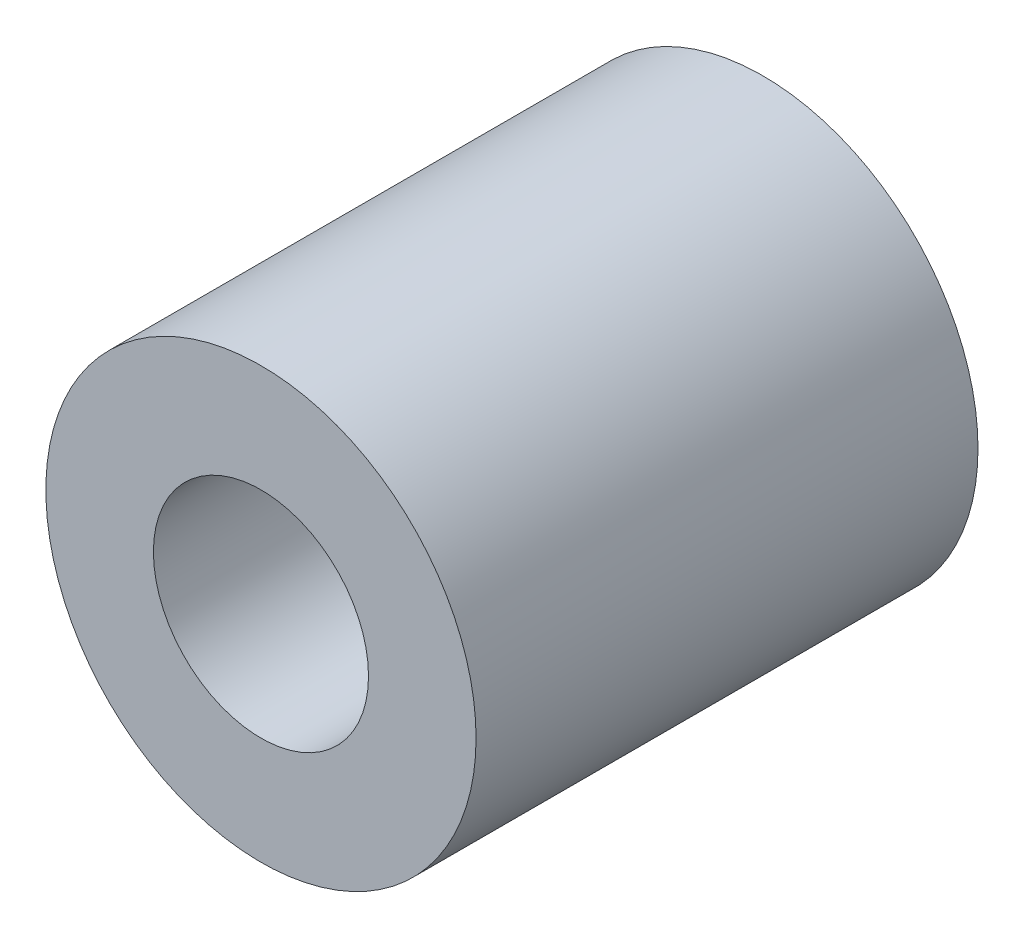
ISO-10303-21;
HEADER;
FILE_DESCRIPTION(('STEP AP214'),'2;1');
FILE_NAME('part.step','',(''),(''),'','','');
FILE_SCHEMA(('AUTOMOTIVE_DESIGN { 1 0 10303 214 1 1 1 1 }'));
ENDSEC;
DATA;
#1=APPLICATION_CONTEXT('core data for automotive mechanical design processes');
#2=APPLICATION_PROTOCOL_DEFINITION('international standard','automotive_design',2000,#1);
#3=PRODUCT_CONTEXT('',#1,'mechanical');
#4=PRODUCT('Part','Part','',(#3));
#5=PRODUCT_RELATED_PRODUCT_CATEGORY('part','',(#4));
#6=PRODUCT_DEFINITION_FORMATION('','',#4);
#7=PRODUCT_DEFINITION_CONTEXT('part definition',#1,'design');
#8=PRODUCT_DEFINITION('design','',#6,#7);
#9=PRODUCT_DEFINITION_SHAPE('','',#8);
#10=(LENGTH_UNIT() NAMED_UNIT(*) SI_UNIT(.MILLI.,.METRE.));
#11=(NAMED_UNIT(*) PLANE_ANGLE_UNIT() SI_UNIT($,.RADIAN.));
#12=(NAMED_UNIT(*) SI_UNIT($,.STERADIAN.) SOLID_ANGLE_UNIT());
#13=UNCERTAINTY_MEASURE_WITH_UNIT(LENGTH_MEASURE(1.E-05),#10,'distance_accuracy_value','');
#14=(GEOMETRIC_REPRESENTATION_CONTEXT(3) GLOBAL_UNCERTAINTY_ASSIGNED_CONTEXT((#13)) GLOBAL_UNIT_ASSIGNED_CONTEXT((#10,
#11,#12)) REPRESENTATION_CONTEXT('',''));
#15=CARTESIAN_POINT('',(0.,0.,0.));
#16=DIRECTION('',(0.,0.,1.));
#17=DIRECTION('',(1.,0.,0.));
#18=AXIS2_PLACEMENT_3D('',#15,#16,#17);
#19=CARTESIAN_POINT('',(0.,0.,35.));
#20=DIRECTION('',(0.,0.,-1.));
#21=DIRECTION('',(-1.,0.,0.));
#22=AXIS2_PLACEMENT_3D('',#19,#20,#21);
#23=CYLINDRICAL_SURFACE('',#22,6.);
#24=CARTESIAN_POINT('',(0.,0.,0.));
#25=DIRECTION('',(0.,0.,1.));
#26=DIRECTION('',(1.,0.,0.));
#27=AXIS2_PLACEMENT_3D('',#24,#25,#26);
#28=CIRCLE('',#27,6.);
#29=CARTESIAN_POINT('',(6.,0.,0.));
#30=VERTEX_POINT('',#29);
#31=EDGE_CURVE('E56',#30,#30,#28,.T.);
#32=ORIENTED_EDGE('',*,*,#31,.F.);
#33=EDGE_LOOP('',(#32));
#34=FACE_BOUND('',#33,.T.);
#35=CARTESIAN_POINT('',(0.,0.,17.5));
#36=DIRECTION('',(0.,0.,1.));
#37=DIRECTION('',(1.,0.,0.));
#38=AXIS2_PLACEMENT_3D('',#35,#36,#37);
#39=CIRCLE('',#38,6.);
#40=CARTESIAN_POINT('',(6.,0.,17.5));
#41=VERTEX_POINT('',#40);
#42=EDGE_CURVE('E60',#41,#41,#39,.T.);
#43=ORIENTED_EDGE('',*,*,#42,.T.);
#44=EDGE_LOOP('',(#43));
#45=FACE_BOUND('',#44,.T.);
#46=ADVANCED_FACE('F41',(#34,#45),#23,.F.);
#47=CARTESIAN_POINT('',(0.,0.,35.));
#48=DIRECTION('',(0.,0.,1.));
#49=DIRECTION('',(1.,0.,0.));
#50=AXIS2_PLACEMENT_3D('',#47,#48,#49);
#51=PLANE('',#50);
#52=CARTESIAN_POINT('',(0.,0.,35.));
#53=DIRECTION('',(0.,0.,1.));
#54=DIRECTION('',(1.,0.,0.));
#55=AXIS2_PLACEMENT_3D('',#52,#53,#54);
#56=CIRCLE('',#55,7.5);
#57=CARTESIAN_POINT('',(7.5,0.,35.));
#58=VERTEX_POINT('',#57);
#59=EDGE_CURVE('E45',#58,#58,#56,.T.);
#60=ORIENTED_EDGE('',*,*,#59,.F.);
#61=EDGE_LOOP('',(#60));
#62=FACE_BOUND('',#61,.T.);
#63=CARTESIAN_POINT('',(0.,0.,35.));
#64=DIRECTION('',(0.,0.,1.));
#65=DIRECTION('',(1.,0.,0.));
#66=AXIS2_PLACEMENT_3D('',#63,#64,#65);
#67=CIRCLE('',#66,15.);
#68=CARTESIAN_POINT('',(15.,0.,35.));
#69=VERTEX_POINT('',#68);
#70=EDGE_CURVE('E10',#69,#69,#67,.T.);
#71=ORIENTED_EDGE('',*,*,#70,.T.);
#72=EDGE_LOOP('',(#71));
#73=FACE_BOUND('',#72,.T.);
#74=ADVANCED_FACE('F88',(#62,#73),#51,.T.);
#75=CARTESIAN_POINT('',(0.,0.,0.));
#76=DIRECTION('',(0.,0.,1.));
#77=DIRECTION('',(1.,0.,0.));
#78=AXIS2_PLACEMENT_3D('',#75,#76,#77);
#79=PLANE('',#78);
#80=CARTESIAN_POINT('',(0.,0.,0.));
#81=DIRECTION('',(0.,0.,1.));
#82=DIRECTION('',(1.,0.,0.));
#83=AXIS2_PLACEMENT_3D('',#80,#81,#82);
#84=CIRCLE('',#83,15.);
#85=CARTESIAN_POINT('',(15.,0.,0.));
#86=VERTEX_POINT('',#85);
#87=EDGE_CURVE('E50',#86,#86,#84,.T.);
#88=ORIENTED_EDGE('',*,*,#87,.F.);
#89=EDGE_LOOP('',(#88));
#90=FACE_BOUND('',#89,.T.);
#91=ORIENTED_EDGE('',*,*,#31,.T.);
#92=EDGE_LOOP('',(#91));
#93=FACE_BOUND('',#92,.T.);
#94=ADVANCED_FACE('F84',(#90,#93),#79,.F.);
#95=CARTESIAN_POINT('',(0.,0.,35.));
#96=DIRECTION('',(0.,0.,-1.));
#97=DIRECTION('',(-1.,0.,0.));
#98=AXIS2_PLACEMENT_3D('',#95,#96,#97);
#99=CYLINDRICAL_SURFACE('',#98,15.);
#100=ORIENTED_EDGE('',*,*,#70,.F.);
#101=EDGE_LOOP('',(#100));
#102=FACE_BOUND('',#101,.T.);
#103=ORIENTED_EDGE('',*,*,#87,.T.);
#104=EDGE_LOOP('',(#103));
#105=FACE_BOUND('',#104,.T.);
#106=ADVANCED_FACE('F43',(#102,#105),#99,.T.);
#107=CARTESIAN_POINT('',(0.,0.,17.5));
#108=DIRECTION('',(0.,0.,1.));
#109=DIRECTION('',(1.,0.,0.));
#110=AXIS2_PLACEMENT_3D('',#107,#108,#109);
#111=CYLINDRICAL_SURFACE('',#110,7.5);
#112=ORIENTED_EDGE('',*,*,#59,.T.);
#113=EDGE_LOOP('',(#112));
#114=FACE_BOUND('',#113,.T.);
#115=CARTESIAN_POINT('',(0.,0.,17.5));
#116=DIRECTION('',(0.,0.,1.));
#117=DIRECTION('',(1.,0.,0.));
#118=AXIS2_PLACEMENT_3D('',#115,#116,#117);
#119=CIRCLE('',#118,7.5);
#120=CARTESIAN_POINT('',(7.5,0.,17.5));
#121=VERTEX_POINT('',#120);
#122=EDGE_CURVE('E63',#121,#121,#119,.T.);
#123=ORIENTED_EDGE('',*,*,#122,.F.);
#124=EDGE_LOOP('',(#123));
#125=FACE_BOUND('',#124,.T.);
#126=ADVANCED_FACE('F74',(#114,#125),#111,.F.);
#127=CARTESIAN_POINT('',(0.,0.,17.5));
#128=DIRECTION('',(0.,0.,1.));
#129=DIRECTION('',(1.,0.,0.));
#130=AXIS2_PLACEMENT_3D('',#127,#128,#129);
#131=PLANE('',#130);
#132=ORIENTED_EDGE('',*,*,#42,.F.);
#133=EDGE_LOOP('',(#132));
#134=FACE_BOUND('',#133,.T.);
#135=ORIENTED_EDGE('',*,*,#122,.T.);
#136=EDGE_LOOP('',(#135));
#137=FACE_BOUND('',#136,.T.);
#138=ADVANCED_FACE('F72',(#134,#137),#131,.T.);
#139=CLOSED_SHELL('',(#46,#74,#94,#106,#126,#138));
#140=MANIFOLD_SOLID_BREP('B2',#139);
#141=ADVANCED_BREP_SHAPE_REPRESENTATION('',(#18,#140),#14);
#142=SHAPE_DEFINITION_REPRESENTATION(#9,#141);
ENDSEC;
END-ISO-10303-21;
